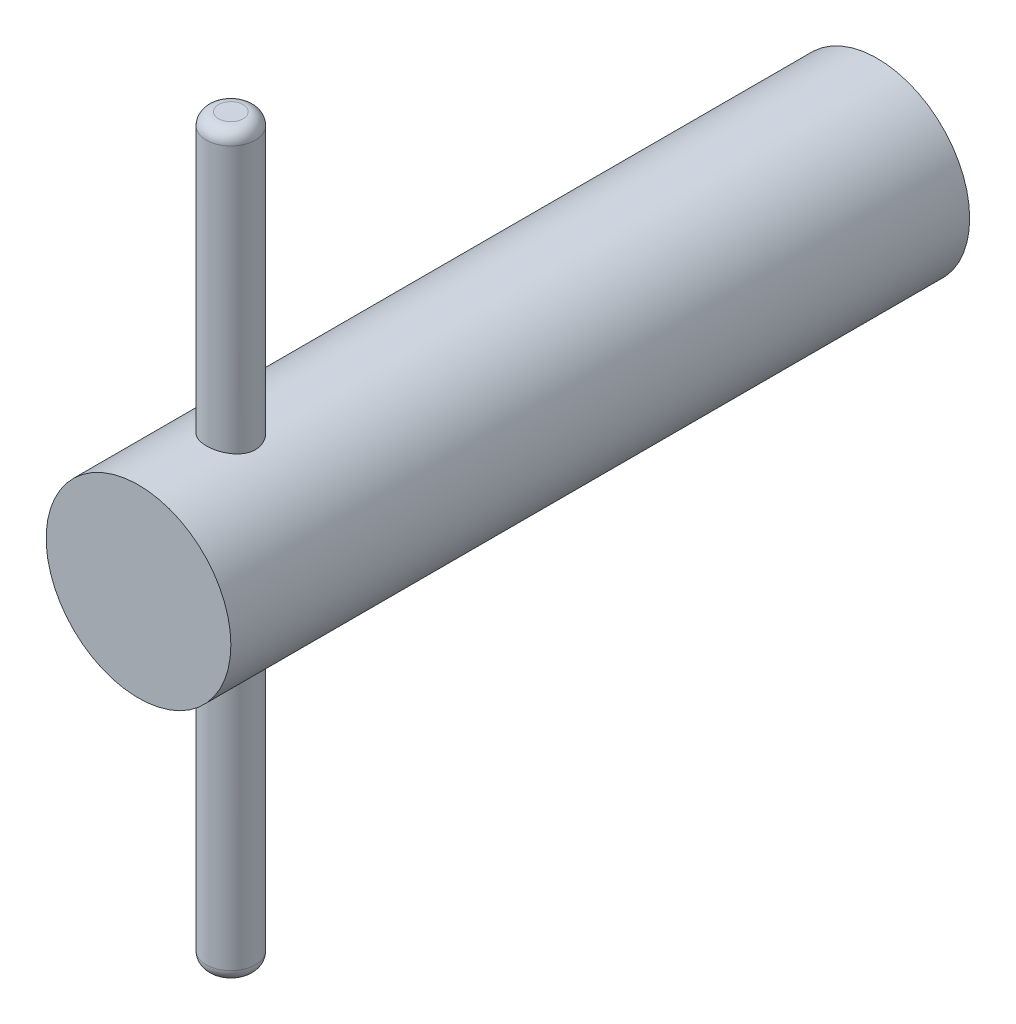
ISO-10303-21;
HEADER;
FILE_DESCRIPTION(('STEP AP214'),'2;1');
FILE_NAME('part.step','',(''),(''),'','','');
FILE_SCHEMA(('AUTOMOTIVE_DESIGN { 1 0 10303 214 1 1 1 1 }'));
ENDSEC;
DATA;
#1=APPLICATION_CONTEXT('core data for automotive mechanical design processes');
#2=APPLICATION_PROTOCOL_DEFINITION('international standard','automotive_design',2000,#1);
#3=PRODUCT_CONTEXT('',#1,'mechanical');
#4=PRODUCT('Part','Part','',(#3));
#5=PRODUCT_RELATED_PRODUCT_CATEGORY('part','',(#4));
#6=PRODUCT_DEFINITION_FORMATION('','',#4);
#7=PRODUCT_DEFINITION_CONTEXT('part definition',#1,'design');
#8=PRODUCT_DEFINITION('design','',#6,#7);
#9=PRODUCT_DEFINITION_SHAPE('','',#8);
#10=(LENGTH_UNIT() NAMED_UNIT(*) SI_UNIT(.MILLI.,.METRE.));
#11=(NAMED_UNIT(*) PLANE_ANGLE_UNIT() SI_UNIT($,.RADIAN.));
#12=(NAMED_UNIT(*) SI_UNIT($,.STERADIAN.) SOLID_ANGLE_UNIT());
#13=UNCERTAINTY_MEASURE_WITH_UNIT(LENGTH_MEASURE(1.E-05),#10,'distance_accuracy_value','');
#14=(GEOMETRIC_REPRESENTATION_CONTEXT(3) GLOBAL_UNCERTAINTY_ASSIGNED_CONTEXT((#13)) GLOBAL_UNIT_ASSIGNED_CONTEXT((#10,
#11,#12)) REPRESENTATION_CONTEXT('',''));
#15=CARTESIAN_POINT('',(0.,0.,0.));
#16=DIRECTION('',(0.,0.,1.));
#17=DIRECTION('',(1.,0.,0.));
#18=AXIS2_PLACEMENT_3D('',#15,#16,#17);
#19=CARTESIAN_POINT('',(0.,0.,120.));
#20=DIRECTION('',(0.,0.,-1.));
#21=DIRECTION('',(-1.,0.,0.));
#22=AXIS2_PLACEMENT_3D('',#19,#20,#21);
#23=CYLINDRICAL_SURFACE('',#22,15.);
#24=CARTESIAN_POINT('',(0.,0.,120.));
#25=DIRECTION('',(0.,0.,1.));
#26=DIRECTION('',(1.,0.,0.));
#27=AXIS2_PLACEMENT_3D('',#24,#25,#26);
#28=CIRCLE('',#27,15.);
#29=CARTESIAN_POINT('',(15.,0.,120.));
#30=VERTEX_POINT('',#29);
#31=EDGE_CURVE('E164',#30,#30,#28,.T.);
#32=ORIENTED_EDGE('',*,*,#31,.F.);
#33=EDGE_LOOP('',(#32));
#34=FACE_BOUND('',#33,.T.);
#35=CARTESIAN_POINT('',(0.,0.,0.));
#36=DIRECTION('',(0.,0.,1.));
#37=DIRECTION('',(1.,0.,0.));
#38=AXIS2_PLACEMENT_3D('',#35,#36,#37);
#39=CIRCLE('',#38,15.);
#40=CARTESIAN_POINT('',(15.,0.,0.));
#41=VERTEX_POINT('',#40);
#42=EDGE_CURVE('E154',#41,#41,#39,.T.);
#43=ORIENTED_EDGE('',*,*,#42,.T.);
#44=EDGE_LOOP('',(#43));
#45=FACE_BOUND('',#44,.T.);
#46=CARTESIAN_POINT('',(0.,-15.,101.));
#47=CARTESIAN_POINT('',(0.220509111665708,-14.9999966762032,101.00000523387));
#48=CARTESIAN_POINT('',(0.44107432044368,-14.995089723243,101.018295228379));
#49=CARTESIAN_POINT('',(0.875850902708927,-14.9759914724332,101.090842461477));
#50=CARTESIAN_POINT('',(1.09005916663817,-14.9617957066517,101.145117008852));
#51=CARTESIAN_POINT('',(1.50578317809062,-14.9256866650558,101.287743333728));
#52=CARTESIAN_POINT('',(1.70731490203056,-14.9037833426075,101.376051175332));
#53=CARTESIAN_POINT('',(2.09270737278531,-14.8545739830336,101.584074485333));
#54=CARTESIAN_POINT('',(2.27656694089925,-14.8272675859036,101.703792046719));
#55=CARTESIAN_POINT('',(2.62565900748003,-14.7694922980399,101.974167032827));
#56=CARTESIAN_POINT('',(2.79042337972558,-14.7389693535736,102.125417336017));
#57=CARTESIAN_POINT('',(3.09257427321276,-14.6785481935918,102.453296966127));
#58=CARTESIAN_POINT('',(3.22995726991329,-14.6486500589449,102.629929555235));
#59=CARTESIAN_POINT('',(3.4757281848683,-14.5923107492874,103.007296469651));
#60=CARTESIAN_POINT('',(3.58357755472975,-14.5659377712648,103.208392656523));
#61=CARTESIAN_POINT('',(3.76375096153988,-14.5204295463637,103.626680222185));
#62=CARTESIAN_POINT('',(3.83608154902738,-14.5012929650653,103.843868624663));
#63=CARTESIAN_POINT('',(3.94153840453008,-14.472982316048,104.28299107565));
#64=CARTESIAN_POINT('',(3.97551340489383,-14.4635929562298,104.504707079861));
#65=CARTESIAN_POINT('',(4.00594069411639,-14.4551966183274,104.950875366613));
#66=CARTESIAN_POINT('',(4.00239999411507,-14.4561877002889,105.175327130048));
#67=CARTESIAN_POINT('',(3.95857020005398,-14.4682475760406,105.613970830748));
#68=CARTESIAN_POINT('',(3.91930812129529,-14.4790347102306,105.828274364077));
#69=CARTESIAN_POINT('',(3.80679497444366,-14.5090202616138,106.247136668912));
#70=CARTESIAN_POINT('',(3.7335411898599,-14.5282193510522,106.451694660151));
#71=CARTESIAN_POINT('',(3.55428713930512,-14.5731132349677,106.847936287617));
#72=CARTESIAN_POINT('',(3.44792682275569,-14.5988788563741,107.039448678573));
#73=CARTESIAN_POINT('',(3.20573007647555,-14.6539645928489,107.402268317703));
#74=CARTESIAN_POINT('',(3.06988784448503,-14.6832854071037,107.573571578313));
#75=CARTESIAN_POINT('',(2.76733214526838,-14.7433502125973,107.89697799491));
#76=CARTESIAN_POINT('',(2.59975625456599,-14.7741094297766,108.04827263663));
#77=CARTESIAN_POINT('',(2.24123533641275,-14.8327276255263,108.320777560701));
#78=CARTESIAN_POINT('',(2.05028938841019,-14.8605864897711,108.441986657405));
#79=CARTESIAN_POINT('',(1.64919651099491,-14.9104364079659,108.651235805649));
#80=CARTESIAN_POINT('',(1.43896980510359,-14.9324014566712,108.739129540897));
#81=CARTESIAN_POINT('',(1.0060045887808,-14.96780088802,108.878094377627));
#82=CARTESIAN_POINT('',(0.783268823856652,-14.981237134675,108.929173525448));
#83=CARTESIAN_POINT('',(0.338508166291034,-14.9977831711677,108.991789753836));
#84=CARTESIAN_POINT('',(0.116648475282763,-15.0011799494192,109.004426079702));
#85=CARTESIAN_POINT('',(-0.326020091802397,-14.9980894338339,108.992833671506));
#86=CARTESIAN_POINT('',(-0.546829074124228,-14.9916031616071,108.968608747788));
#87=CARTESIAN_POINT('',(-0.977204899803559,-14.9696607099204,108.88488310508));
#88=CARTESIAN_POINT('',(-1.18689970405556,-14.9543605309265,108.825995507604));
#89=CARTESIAN_POINT('',(-1.59341394235213,-14.9165258978828,108.675328110984));
#90=CARTESIAN_POINT('',(-1.79023197843205,-14.8939906599234,108.583544747499));
#91=CARTESIAN_POINT('',(-2.1696769493359,-14.8435132111904,108.367652225639));
#92=CARTESIAN_POINT('',(-2.35195037692237,-14.8154737320985,108.242945066405));
#93=CARTESIAN_POINT('',(-2.6933692707943,-14.7572290473119,107.965496739684));
#94=CARTESIAN_POINT('',(-2.85251015759837,-14.7270234145527,107.812750034798));
#95=CARTESIAN_POINT('',(-3.14777848957546,-14.6667949173317,107.478428845011));
#96=CARTESIAN_POINT('',(-3.28313038499627,-14.6368012285772,107.296162877209));
#97=CARTESIAN_POINT('',(-3.52134382370242,-14.5813289436636,106.910870607801));
#98=CARTESIAN_POINT('',(-3.62420672244342,-14.5558501591602,106.707845172756));
#99=CARTESIAN_POINT('',(-3.79374823172205,-14.5125853674305,106.287809385847));
#100=CARTESIAN_POINT('',(-3.86063624507841,-14.4947549662348,106.070888376362));
#101=CARTESIAN_POINT('',(-3.95682410237657,-14.4687965026614,105.628321360653));
#102=CARTESIAN_POINT('',(-3.98613355205236,-14.4606659608681,105.402677599313));
#103=CARTESIAN_POINT('',(-4.00577979307212,-14.4552348910192,104.957010424211));
#104=CARTESIAN_POINT('',(-3.99736311235129,-14.4575879532022,104.737045359427));
#105=CARTESIAN_POINT('',(-3.94468751999858,-14.4720479199639,104.30179297193));
#106=CARTESIAN_POINT('',(-3.9004295306998,-14.4841545735456,104.08650552899));
#107=CARTESIAN_POINT('',(-3.77805031399794,-14.5165514219021,103.66828849576));
#108=CARTESIAN_POINT('',(-3.70019322151266,-14.5367777005106,103.465276314541));
#109=CARTESIAN_POINT('',(-3.51303109124666,-14.5831363626058,103.075042338926));
#110=CARTESIAN_POINT('',(-3.40372112049204,-14.6092696723953,102.887823027398));
#111=CARTESIAN_POINT('',(-3.15297818537663,-14.6654584288421,102.528539281008));
#112=CARTESIAN_POINT('',(-3.01069459535827,-14.6956066620426,102.357082930048));
#113=CARTESIAN_POINT('',(-2.69966107022193,-14.7559100756513,102.040075096665));
#114=CARTESIAN_POINT('',(-2.53090470871747,-14.7860652559664,101.894529922662));
#115=CARTESIAN_POINT('',(-2.16735996217739,-14.8437562480818,101.630415524706));
#116=CARTESIAN_POINT('',(-1.97209192350357,-14.8712222262917,101.512489978701));
#117=CARTESIAN_POINT('',(-1.56377728083377,-14.9196762020573,101.311325168141));
#118=CARTESIAN_POINT('',(-1.35074218939259,-14.9406683536717,101.228063648673));
#119=CARTESIAN_POINT('',(-0.948749409761977,-14.9710950502695,101.109449429169));
#120=CARTESIAN_POINT('',(-0.761524033130068,-14.9818554118521,101.068501232815));
#121=CARTESIAN_POINT('',(-0.382879590634151,-14.9963089807291,101.013775587666));
#122=CARTESIAN_POINT('',(-0.19146094080972,-15.0000028859454,100.9999954556));
#123=CARTESIAN_POINT('',(0.,-15.,101.));
#124=B_SPLINE_CURVE_WITH_KNOTS('',3,(#46,#47,#48,#49,#50,#51,#52,#53,#54,#55,#56,#57,#58,#59,
#60,#61,#62,#63,#64,#65,#66,#67,#68,#69,#70,#71,#72,#73,#74,#75,#76,#77,#78,#79,#80,#81,#82,#83,
#84,#85,#86,#87,#88,#89,#90,#91,#92,#93,#94,#95,#96,#97,#98,#99,#100,#101,#102,#103,#104,#105,
#106,#107,#108,#109,#110,#111,#112,#113,#114,#115,#116,#117,#118,#119,#120,#121,#122,#123),
.UNSPECIFIED.,.T.,.F.,(4,2,2,2,2,2,2,2,2,2,2,2,2,2,2,2,2,2,2,2,2,2,2,2,2,2,2,2,2,2,2,2,2,2,2,2,
2,2,4),(0.,0.660825197899138,1.3219684875229,1.98226110594386,2.64259773417351,3.31669795909934,
3.99088489850298,4.67665165046457,5.36229188259399,6.03244316500937,6.7024692080864,
7.35382004091993,8.00522293625879,8.66397346692996,9.3228537623526,10.0032251962464,
10.6836234387519,11.3669761920608,12.0501795438028,12.7136543504909,13.377060578507,
14.0290707128423,14.6811515155123,15.346005720091,16.0109913651777,16.6947299276558,
17.3784399604822,18.0581259539877,18.7376381732797,19.394866848109,20.0520786104837,
20.7042153090379,21.356454342532,22.0278867914997,22.6994824867209,23.3854450456898,
24.0709665229755,24.6447963799386,25.2185695593995),.UNSPECIFIED.);
#125=CARTESIAN_POINT('',(0.,-15.,101.));
#126=VERTEX_POINT('',#125);
#127=EDGE_CURVE('E168',#126,#126,#124,.T.);
#128=ORIENTED_EDGE('',*,*,#127,.F.);
#129=EDGE_LOOP('',(#128));
#130=FACE_BOUND('',#129,.T.);
#131=CARTESIAN_POINT('',(0.,15.,101.));
#132=CARTESIAN_POINT('',(-0.220509111665708,14.9999966762032,101.00000523387));
#133=CARTESIAN_POINT('',(-0.44107432044368,14.995089723243,101.018295228379));
#134=CARTESIAN_POINT('',(-0.875850902708927,14.9759914724332,101.090842461477));
#135=CARTESIAN_POINT('',(-1.09005916663817,14.9617957066517,101.145117008852));
#136=CARTESIAN_POINT('',(-1.50578317809062,14.9256866650558,101.287743333728));
#137=CARTESIAN_POINT('',(-1.70731490203056,14.9037833426075,101.376051175332));
#138=CARTESIAN_POINT('',(-2.09270737278531,14.8545739830336,101.584074485333));
#139=CARTESIAN_POINT('',(-2.27656694089925,14.8272675859036,101.703792046719));
#140=CARTESIAN_POINT('',(-2.62565900748003,14.7694922980399,101.974167032827));
#141=CARTESIAN_POINT('',(-2.79042337972558,14.7389693535736,102.125417336017));
#142=CARTESIAN_POINT('',(-3.09257427321276,14.6785481935918,102.453296966127));
#143=CARTESIAN_POINT('',(-3.22995726991329,14.6486500589449,102.629929555235));
#144=CARTESIAN_POINT('',(-3.4757281848683,14.5923107492874,103.007296469651));
#145=CARTESIAN_POINT('',(-3.58357755472975,14.5659377712648,103.208392656523));
#146=CARTESIAN_POINT('',(-3.76375096153988,14.5204295463637,103.626680222185));
#147=CARTESIAN_POINT('',(-3.83608154902738,14.5012929650653,103.843868624663));
#148=CARTESIAN_POINT('',(-3.94153840453008,14.472982316048,104.28299107565));
#149=CARTESIAN_POINT('',(-3.97551340489383,14.4635929562298,104.504707079861));
#150=CARTESIAN_POINT('',(-4.00594069411639,14.4551966183274,104.950875366613));
#151=CARTESIAN_POINT('',(-4.00239999411507,14.4561877002889,105.175327130048));
#152=CARTESIAN_POINT('',(-3.95857020005398,14.4682475760406,105.613970830748));
#153=CARTESIAN_POINT('',(-3.91930812129529,14.4790347102306,105.828274364077));
#154=CARTESIAN_POINT('',(-3.80679497444366,14.5090202616138,106.247136668912));
#155=CARTESIAN_POINT('',(-3.7335411898599,14.5282193510522,106.451694660151));
#156=CARTESIAN_POINT('',(-3.55428713930512,14.5731132349677,106.847936287617));
#157=CARTESIAN_POINT('',(-3.44792682275569,14.5988788563741,107.039448678573));
#158=CARTESIAN_POINT('',(-3.20573007647555,14.6539645928489,107.402268317703));
#159=CARTESIAN_POINT('',(-3.06988784448503,14.6832854071037,107.573571578313));
#160=CARTESIAN_POINT('',(-2.76733214526838,14.7433502125973,107.89697799491));
#161=CARTESIAN_POINT('',(-2.59975625456599,14.7741094297766,108.04827263663));
#162=CARTESIAN_POINT('',(-2.24123533641275,14.8327276255263,108.320777560701));
#163=CARTESIAN_POINT('',(-2.05028938841019,14.8605864897711,108.441986657405));
#164=CARTESIAN_POINT('',(-1.64919651099491,14.9104364079659,108.651235805649));
#165=CARTESIAN_POINT('',(-1.43896980510359,14.9324014566712,108.739129540897));
#166=CARTESIAN_POINT('',(-1.0060045887808,14.96780088802,108.878094377627));
#167=CARTESIAN_POINT('',(-0.783268823856652,14.981237134675,108.929173525448));
#168=CARTESIAN_POINT('',(-0.338508166291034,14.9977831711677,108.991789753836));
#169=CARTESIAN_POINT('',(-0.116648475282763,15.0011799494192,109.004426079702));
#170=CARTESIAN_POINT('',(0.326020091802397,14.9980894338339,108.992833671506));
#171=CARTESIAN_POINT('',(0.546829074124228,14.9916031616071,108.968608747788));
#172=CARTESIAN_POINT('',(0.977204899803559,14.9696607099204,108.88488310508));
#173=CARTESIAN_POINT('',(1.18689970405556,14.9543605309265,108.825995507604));
#174=CARTESIAN_POINT('',(1.59341394235213,14.9165258978828,108.675328110984));
#175=CARTESIAN_POINT('',(1.79023197843205,14.8939906599234,108.583544747499));
#176=CARTESIAN_POINT('',(2.1696769493359,14.8435132111904,108.367652225639));
#177=CARTESIAN_POINT('',(2.35195037692237,14.8154737320985,108.242945066405));
#178=CARTESIAN_POINT('',(2.6933692707943,14.7572290473119,107.965496739684));
#179=CARTESIAN_POINT('',(2.85251015759837,14.7270234145527,107.812750034798));
#180=CARTESIAN_POINT('',(3.14777848957546,14.6667949173317,107.478428845011));
#181=CARTESIAN_POINT('',(3.28313038499627,14.6368012285772,107.296162877209));
#182=CARTESIAN_POINT('',(3.52134382370242,14.5813289436636,106.910870607801));
#183=CARTESIAN_POINT('',(3.62420672244342,14.5558501591602,106.707845172756));
#184=CARTESIAN_POINT('',(3.79374823172205,14.5125853674305,106.287809385847));
#185=CARTESIAN_POINT('',(3.86063624507841,14.4947549662348,106.070888376362));
#186=CARTESIAN_POINT('',(3.95682410237657,14.4687965026614,105.628321360653));
#187=CARTESIAN_POINT('',(3.98613355205236,14.4606659608681,105.402677599313));
#188=CARTESIAN_POINT('',(4.00577979307212,14.4552348910192,104.957010424211));
#189=CARTESIAN_POINT('',(3.99736311235129,14.4575879532022,104.737045359427));
#190=CARTESIAN_POINT('',(3.94468751999858,14.4720479199639,104.30179297193));
#191=CARTESIAN_POINT('',(3.9004295306998,14.4841545735456,104.08650552899));
#192=CARTESIAN_POINT('',(3.77805031399794,14.5165514219021,103.66828849576));
#193=CARTESIAN_POINT('',(3.70019322151266,14.5367777005106,103.465276314541));
#194=CARTESIAN_POINT('',(3.51303109124666,14.5831363626058,103.075042338926));
#195=CARTESIAN_POINT('',(3.40372112049204,14.6092696723953,102.887823027398));
#196=CARTESIAN_POINT('',(3.15297818537663,14.6654584288421,102.528539281008));
#197=CARTESIAN_POINT('',(3.01069459535827,14.6956066620426,102.357082930048));
#198=CARTESIAN_POINT('',(2.69966107022193,14.7559100756513,102.040075096665));
#199=CARTESIAN_POINT('',(2.53090470871747,14.7860652559664,101.894529922662));
#200=CARTESIAN_POINT('',(2.16735996217739,14.8437562480818,101.630415524706));
#201=CARTESIAN_POINT('',(1.97209192350357,14.8712222262917,101.512489978701));
#202=CARTESIAN_POINT('',(1.56377728083377,14.9196762020573,101.311325168141));
#203=CARTESIAN_POINT('',(1.35074218939259,14.9406683536717,101.228063648673));
#204=CARTESIAN_POINT('',(0.948749409761977,14.9710950502695,101.109449429169));
#205=CARTESIAN_POINT('',(0.761524033130068,14.9818554118521,101.068501232815));
#206=CARTESIAN_POINT('',(0.382879590634151,14.9963089807291,101.013775587666));
#207=CARTESIAN_POINT('',(0.19146094080972,15.0000028859454,100.9999954556));
#208=CARTESIAN_POINT('',(0.,15.,101.));
#209=B_SPLINE_CURVE_WITH_KNOTS('',3,(#131,#132,#133,#134,#135,#136,#137,#138,#139,#140,#141,
#142,#143,#144,#145,#146,#147,#148,#149,#150,#151,#152,#153,#154,#155,#156,#157,#158,#159,#160,
#161,#162,#163,#164,#165,#166,#167,#168,#169,#170,#171,#172,#173,#174,#175,#176,#177,#178,#179,
#180,#181,#182,#183,#184,#185,#186,#187,#188,#189,#190,#191,#192,#193,#194,#195,#196,#197,#198,
#199,#200,#201,#202,#203,#204,#205,#206,#207,#208),.UNSPECIFIED.,.T.,.F.,(4,2,2,2,2,2,2,2,2,2,2,
2,2,2,2,2,2,2,2,2,2,2,2,2,2,2,2,2,2,2,2,2,2,2,2,2,2,2,4),(0.,0.660825197899138,1.3219684875229,
1.98226110594386,2.64259773417351,3.31669795909934,3.99088489850298,4.67665165046457,
5.36229188259399,6.03244316500937,6.7024692080864,7.35382004091993,8.00522293625879,
8.66397346692996,9.3228537623526,10.0032251962464,10.6836234387519,11.3669761920608,
12.0501795438028,12.7136543504909,13.377060578507,14.0290707128423,14.6811515155123,
15.346005720091,16.0109913651777,16.6947299276558,17.3784399604822,18.0581259539877,
18.7376381732797,19.394866848109,20.0520786104837,20.7042153090379,21.356454342532,
22.0278867914997,22.6994824867209,23.3854450456898,24.0709665229755,24.6447963799386,
25.2185695593995),.UNSPECIFIED.);
#210=CARTESIAN_POINT('',(0.,15.,101.));
#211=VERTEX_POINT('',#210);
#212=EDGE_CURVE('E180',#211,#211,#209,.T.);
#213=ORIENTED_EDGE('',*,*,#212,.F.);
#214=EDGE_LOOP('',(#213));
#215=FACE_BOUND('',#214,.T.);
#216=ADVANCED_FACE('F39',(#34,#45,#130,#215),#23,.T.);
#217=CARTESIAN_POINT('',(0.,0.,120.));
#218=DIRECTION('',(0.,0.,1.));
#219=DIRECTION('',(1.,0.,0.));
#220=AXIS2_PLACEMENT_3D('',#217,#218,#219);
#221=PLANE('',#220);
#222=ORIENTED_EDGE('',*,*,#31,.T.);
#223=EDGE_LOOP('',(#222));
#224=FACE_BOUND('',#223,.T.);
#225=ADVANCED_FACE('F219',(#224),#221,.T.);
#226=CARTESIAN_POINT('',(0.,0.,0.));
#227=DIRECTION('',(0.,0.,1.));
#228=DIRECTION('',(1.,0.,0.));
#229=AXIS2_PLACEMENT_3D('',#226,#227,#228);
#230=PLANE('',#229);
#231=DIRECTION('',(0.999994954580918,-0.00317660395844476,0.));
#232=VECTOR('',#231,1.);
#233=CARTESIAN_POINT('',(-5.74170752257116,10.0182896773143,0.));
#234=LINE('',#233,#232);
#235=CARTESIAN_POINT('',(-5.74170752257116,10.0182896773143,0.));
#236=VERTEX_POINT('',#235);
#237=CARTESIAN_POINT('',(5.80523960174005,9.98160941430401,0.));
#238=VERTEX_POINT('',#237);
#239=EDGE_CURVE('E135',#236,#238,#234,.T.);
#240=ORIENTED_EDGE('',*,*,#239,.F.);
#241=DIRECTION('',(0.502748497016234,0.864432732344118,0.));
#242=VECTOR('',#241,1.);
#243=CARTESIAN_POINT('',(-11.5469471243112,0.0366802630103418,0.));
#244=LINE('',#243,#242);
#245=CARTESIAN_POINT('',(-11.5469471243112,0.0366802630103418,0.));
#246=VERTEX_POINT('',#245);
#247=EDGE_CURVE('E55',#246,#236,#244,.T.);
#248=ORIENTED_EDGE('',*,*,#247,.F.);
#249=DIRECTION('',(-0.497246457564683,0.867609336302563,0.));
#250=VECTOR('',#249,1.);
#251=CARTESIAN_POINT('',(-5.80523960174005,-9.98160941430401,0.));
#252=LINE('',#251,#250);
#253=CARTESIAN_POINT('',(-5.80523960174005,-9.98160941430401,0.));
#254=VERTEX_POINT('',#253);
#255=EDGE_CURVE('E148',#254,#246,#252,.T.);
#256=ORIENTED_EDGE('',*,*,#255,.F.);
#257=DIRECTION('',(-0.999994954580917,0.00317660395844491,0.));
#258=VECTOR('',#257,1.);
#259=CARTESIAN_POINT('',(5.74170752257115,-10.0182896773143,0.));
#260=LINE('',#259,#258);
#261=CARTESIAN_POINT('',(5.74170752257115,-10.0182896773143,0.));
#262=VERTEX_POINT('',#261);
#263=EDGE_CURVE('E145',#262,#254,#260,.T.);
#264=ORIENTED_EDGE('',*,*,#263,.F.);
#265=DIRECTION('',(-0.502748497016234,-0.864432732344118,0.));
#266=VECTOR('',#265,1.);
#267=CARTESIAN_POINT('',(11.5469471243112,-0.0366802630103424,0.));
#268=LINE('',#267,#266);
#269=CARTESIAN_POINT('',(11.5469471243112,-0.0366802630103424,0.));
#270=VERTEX_POINT('',#269);
#271=EDGE_CURVE('E103',#270,#262,#268,.T.);
#272=ORIENTED_EDGE('',*,*,#271,.F.);
#273=DIRECTION('',(0.497246457564683,-0.867609336302563,0.));
#274=VECTOR('',#273,1.);
#275=CARTESIAN_POINT('',(5.80523960174005,9.98160941430401,0.));
#276=LINE('',#275,#274);
#277=EDGE_CURVE('E139',#238,#270,#276,.T.);
#278=ORIENTED_EDGE('',*,*,#277,.F.);
#279=EDGE_LOOP('',(#240,#248,#256,#264,#272,#278));
#280=FACE_BOUND('',#279,.T.);
#281=ORIENTED_EDGE('',*,*,#42,.F.);
#282=EDGE_LOOP('',(#281));
#283=FACE_BOUND('',#282,.T.);
#284=ADVANCED_FACE('F218',(#280,#283),#230,.F.);
#285=CARTESIAN_POINT('',(-11.5469471243112,0.0366802630103418,50.));
#286=DIRECTION('',(-0.864432732344118,0.502748497016234,0.));
#287=DIRECTION('',(-0.502748497016234,-0.864432732344118,0.));
#288=AXIS2_PLACEMENT_3D('',#285,#286,#287);
#289=PLANE('',#288);
#290=ORIENTED_EDGE('',*,*,#247,.T.);
#291=DIRECTION('',(0.,0.,-1.));
#292=VECTOR('',#291,1.);
#293=CARTESIAN_POINT('',(-5.74170752257116,10.0182896773143,50.));
#294=LINE('',#293,#292);
#295=CARTESIAN_POINT('',(-5.74170752257116,10.0182896773143,50.));
#296=VERTEX_POINT('',#295);
#297=EDGE_CURVE('E85',#296,#236,#294,.T.);
#298=ORIENTED_EDGE('',*,*,#297,.F.);
#299=DIRECTION('',(0.502748497016234,0.864432732344118,0.));
#300=VECTOR('',#299,1.);
#301=CARTESIAN_POINT('',(-11.5469471243112,0.0366802630103418,50.));
#302=LINE('',#301,#300);
#303=CARTESIAN_POINT('',(-11.5469471243112,0.0366802630103418,50.));
#304=VERTEX_POINT('',#303);
#305=EDGE_CURVE('E151',#304,#296,#302,.T.);
#306=ORIENTED_EDGE('',*,*,#305,.F.);
#307=DIRECTION('',(0.,0.,-1.));
#308=VECTOR('',#307,1.);
#309=CARTESIAN_POINT('',(-11.5469471243112,0.0366802630103418,50.));
#310=LINE('',#309,#308);
#311=EDGE_CURVE('E63',#304,#246,#310,.T.);
#312=ORIENTED_EDGE('',*,*,#311,.T.);
#313=EDGE_LOOP('',(#290,#298,#306,#312));
#314=FACE_BOUND('',#313,.T.);
#315=ADVANCED_FACE('F204',(#314),#289,.F.);
#316=CARTESIAN_POINT('',(-5.80523960174005,-9.98160941430401,50.));
#317=DIRECTION('',(-0.867609336302563,-0.497246457564683,0.));
#318=DIRECTION('',(0.497246457564683,-0.867609336302563,0.));
#319=AXIS2_PLACEMENT_3D('',#316,#317,#318);
#320=PLANE('',#319);
#321=ORIENTED_EDGE('',*,*,#255,.T.);
#322=ORIENTED_EDGE('',*,*,#311,.F.);
#323=DIRECTION('',(-0.497246457564683,0.867609336302563,0.));
#324=VECTOR('',#323,1.);
#325=CARTESIAN_POINT('',(-5.80523960174005,-9.98160941430401,50.));
#326=LINE('',#325,#324);
#327=CARTESIAN_POINT('',(-5.80523960174005,-9.98160941430401,50.));
#328=VERTEX_POINT('',#327);
#329=EDGE_CURVE('E117',#328,#304,#326,.T.);
#330=ORIENTED_EDGE('',*,*,#329,.F.);
#331=DIRECTION('',(0.,0.,-1.));
#332=VECTOR('',#331,1.);
#333=CARTESIAN_POINT('',(-5.80523960174005,-9.98160941430401,50.));
#334=LINE('',#333,#332);
#335=EDGE_CURVE('E108',#328,#254,#334,.T.);
#336=ORIENTED_EDGE('',*,*,#335,.T.);
#337=EDGE_LOOP('',(#321,#322,#330,#336));
#338=FACE_BOUND('',#337,.T.);
#339=ADVANCED_FACE('F201',(#338),#320,.F.);
#340=CARTESIAN_POINT('',(5.74170752257115,-10.0182896773143,50.));
#341=DIRECTION('',(-0.00317660395844491,-0.999994954580917,0.));
#342=DIRECTION('',(0.999994954580917,-0.00317660395844491,0.));
#343=AXIS2_PLACEMENT_3D('',#340,#341,#342);
#344=PLANE('',#343);
#345=ORIENTED_EDGE('',*,*,#263,.T.);
#346=ORIENTED_EDGE('',*,*,#335,.F.);
#347=DIRECTION('',(-0.999994954580917,0.00317660395844491,0.));
#348=VECTOR('',#347,1.);
#349=CARTESIAN_POINT('',(5.74170752257115,-10.0182896773143,50.));
#350=LINE('',#349,#348);
#351=CARTESIAN_POINT('',(5.74170752257115,-10.0182896773143,50.));
#352=VERTEX_POINT('',#351);
#353=EDGE_CURVE('E112',#352,#328,#350,.T.);
#354=ORIENTED_EDGE('',*,*,#353,.F.);
#355=DIRECTION('',(0.,0.,-1.));
#356=VECTOR('',#355,1.);
#357=CARTESIAN_POINT('',(5.74170752257115,-10.0182896773143,50.));
#358=LINE('',#357,#356);
#359=EDGE_CURVE('E96',#352,#262,#358,.T.);
#360=ORIENTED_EDGE('',*,*,#359,.T.);
#361=EDGE_LOOP('',(#345,#346,#354,#360));
#362=FACE_BOUND('',#361,.T.);
#363=ADVANCED_FACE('F113',(#362),#344,.F.);
#364=CARTESIAN_POINT('',(11.5469471243112,-0.0366802630103424,50.));
#365=DIRECTION('',(0.864432732344118,-0.502748497016234,0.));
#366=DIRECTION('',(0.502748497016234,0.864432732344118,0.));
#367=AXIS2_PLACEMENT_3D('',#364,#365,#366);
#368=PLANE('',#367);
#369=ORIENTED_EDGE('',*,*,#271,.T.);
#370=ORIENTED_EDGE('',*,*,#359,.F.);
#371=DIRECTION('',(-0.502748497016234,-0.864432732344118,0.));
#372=VECTOR('',#371,1.);
#373=CARTESIAN_POINT('',(11.5469471243112,-0.0366802630103424,50.));
#374=LINE('',#373,#372);
#375=CARTESIAN_POINT('',(11.5469471243112,-0.0366802630103424,50.));
#376=VERTEX_POINT('',#375);
#377=EDGE_CURVE('E100',#376,#352,#374,.T.);
#378=ORIENTED_EDGE('',*,*,#377,.F.);
#379=DIRECTION('',(0.,0.,-1.));
#380=VECTOR('',#379,1.);
#381=CARTESIAN_POINT('',(11.5469471243112,-0.0366802630103424,50.));
#382=LINE('',#381,#380);
#383=EDGE_CURVE('E109',#376,#270,#382,.T.);
#384=ORIENTED_EDGE('',*,*,#383,.T.);
#385=EDGE_LOOP('',(#369,#370,#378,#384));
#386=FACE_BOUND('',#385,.T.);
#387=ADVANCED_FACE('F98',(#386),#368,.F.);
#388=CARTESIAN_POINT('',(5.80523960174005,9.98160941430401,50.));
#389=DIRECTION('',(0.867609336302563,0.497246457564683,0.));
#390=DIRECTION('',(-0.497246457564683,0.867609336302563,0.));
#391=AXIS2_PLACEMENT_3D('',#388,#389,#390);
#392=PLANE('',#391);
#393=ORIENTED_EDGE('',*,*,#277,.T.);
#394=ORIENTED_EDGE('',*,*,#383,.F.);
#395=DIRECTION('',(0.497246457564683,-0.867609336302563,0.));
#396=VECTOR('',#395,1.);
#397=CARTESIAN_POINT('',(5.80523960174005,9.98160941430401,50.));
#398=LINE('',#397,#396);
#399=CARTESIAN_POINT('',(5.80523960174005,9.98160941430401,50.));
#400=VERTEX_POINT('',#399);
#401=EDGE_CURVE('E123',#400,#376,#398,.T.);
#402=ORIENTED_EDGE('',*,*,#401,.F.);
#403=DIRECTION('',(0.,0.,-1.));
#404=VECTOR('',#403,1.);
#405=CARTESIAN_POINT('',(5.80523960174005,9.98160941430401,50.));
#406=LINE('',#405,#404);
#407=EDGE_CURVE('E159',#400,#238,#406,.T.);
#408=ORIENTED_EDGE('',*,*,#407,.T.);
#409=EDGE_LOOP('',(#393,#394,#402,#408));
#410=FACE_BOUND('',#409,.T.);
#411=ADVANCED_FACE('F209',(#410),#392,.F.);
#412=CARTESIAN_POINT('',(-5.74170752257116,10.0182896773143,50.));
#413=DIRECTION('',(0.00317660395844476,0.999994954580917,0.));
#414=DIRECTION('',(-0.999994954580917,0.00317660395844476,0.));
#415=AXIS2_PLACEMENT_3D('',#412,#413,#414);
#416=PLANE('',#415);
#417=ORIENTED_EDGE('',*,*,#239,.T.);
#418=ORIENTED_EDGE('',*,*,#407,.F.);
#419=DIRECTION('',(0.999994954580918,-0.00317660395844476,0.));
#420=VECTOR('',#419,1.);
#421=CARTESIAN_POINT('',(-5.74170752257116,10.0182896773143,50.));
#422=LINE('',#421,#420);
#423=EDGE_CURVE('E127',#296,#400,#422,.T.);
#424=ORIENTED_EDGE('',*,*,#423,.F.);
#425=ORIENTED_EDGE('',*,*,#297,.T.);
#426=EDGE_LOOP('',(#417,#418,#424,#425));
#427=FACE_BOUND('',#426,.T.);
#428=ADVANCED_FACE('F200',(#427),#416,.F.);
#429=CARTESIAN_POINT('',(0.,0.,50.));
#430=DIRECTION('',(0.,0.,-1.));
#431=DIRECTION('',(-1.,0.,0.));
#432=AXIS2_PLACEMENT_3D('',#429,#430,#431);
#433=PLANE('',#432);
#434=ORIENTED_EDGE('',*,*,#305,.T.);
#435=ORIENTED_EDGE('',*,*,#423,.T.);
#436=ORIENTED_EDGE('',*,*,#401,.T.);
#437=ORIENTED_EDGE('',*,*,#377,.T.);
#438=ORIENTED_EDGE('',*,*,#353,.T.);
#439=ORIENTED_EDGE('',*,*,#329,.T.);
#440=EDGE_LOOP('',(#434,#435,#436,#437,#438,#439));
#441=FACE_BOUND('',#440,.T.);
#442=ADVANCED_FACE('F120',(#441),#433,.T.);
#443=CARTESIAN_POINT('',(0.,-60.,105.));
#444=DIRECTION('',(0.,1.,0.));
#445=DIRECTION('',(0.,0.,1.));
#446=AXIS2_PLACEMENT_3D('',#443,#444,#445);
#447=PLANE('',#446);
#448=CARTESIAN_POINT('',(0.,-60.,105.));
#449=DIRECTION('',(0.,1.,0.));
#450=DIRECTION('',(0.,0.,1.));
#451=AXIS2_PLACEMENT_3D('',#448,#449,#450);
#452=CIRCLE('',#451,2.);
#453=CARTESIAN_POINT('',(0.,-60.,107.));
#454=VERTEX_POINT('',#453);
#455=EDGE_CURVE('E245',#454,#454,#452,.F.);
#456=ORIENTED_EDGE('',*,*,#455,.T.);
#457=EDGE_LOOP('',(#456));
#458=FACE_BOUND('',#457,.T.);
#459=ADVANCED_FACE('F195',(#458),#447,.F.);
#460=CARTESIAN_POINT('',(0.,60.,105.));
#461=DIRECTION('',(0.,-1.,0.));
#462=DIRECTION('',(0.,0.,-1.));
#463=AXIS2_PLACEMENT_3D('',#460,#461,#462);
#464=CYLINDRICAL_SURFACE('',#463,4.);
#465=CARTESIAN_POINT('',(0.,-58.,105.));
#466=DIRECTION('',(0.,1.,0.));
#467=DIRECTION('',(0.,0.,1.));
#468=AXIS2_PLACEMENT_3D('',#465,#466,#467);
#469=CIRCLE('',#468,4.);
#470=CARTESIAN_POINT('',(0.,-58.,109.));
#471=VERTEX_POINT('',#470);
#472=EDGE_CURVE('E242',#471,#471,#469,.T.);
#473=ORIENTED_EDGE('',*,*,#472,.T.);
#474=EDGE_LOOP('',(#473));
#475=FACE_BOUND('',#474,.T.);
#476=ORIENTED_EDGE('',*,*,#127,.T.);
#477=EDGE_LOOP('',(#476));
#478=FACE_BOUND('',#477,.T.);
#479=ADVANCED_FACE('F193',(#475,#478),#464,.T.);
#480=CARTESIAN_POINT('',(0.,58.,105.));
#481=DIRECTION('',(0.,1.,0.));
#482=DIRECTION('',(0.,0.,1.));
#483=AXIS2_PLACEMENT_3D('',#480,#481,#482);
#484=CIRCLE('',#483,4.);
#485=CARTESIAN_POINT('',(0.,58.,109.));
#486=VERTEX_POINT('',#485);
#487=EDGE_CURVE('E11',#486,#486,#484,.F.);
#488=ORIENTED_EDGE('',*,*,#487,.T.);
#489=EDGE_LOOP('',(#488));
#490=FACE_BOUND('',#489,.T.);
#491=ORIENTED_EDGE('',*,*,#212,.T.);
#492=EDGE_LOOP('',(#491));
#493=FACE_BOUND('',#492,.T.);
#494=ADVANCED_FACE('F187',(#490,#493),#464,.T.);
#495=CARTESIAN_POINT('',(0.,60.,105.));
#496=DIRECTION('',(0.,1.,0.));
#497=DIRECTION('',(0.,0.,1.));
#498=AXIS2_PLACEMENT_3D('',#495,#496,#497);
#499=PLANE('',#498);
#500=CARTESIAN_POINT('',(0.,60.,105.));
#501=DIRECTION('',(0.,1.,0.));
#502=DIRECTION('',(0.,0.,1.));
#503=AXIS2_PLACEMENT_3D('',#500,#501,#502);
#504=CIRCLE('',#503,2.);
#505=CARTESIAN_POINT('',(0.,60.,107.));
#506=VERTEX_POINT('',#505);
#507=EDGE_CURVE('E48',#506,#506,#504,.T.);
#508=ORIENTED_EDGE('',*,*,#507,.T.);
#509=EDGE_LOOP('',(#508));
#510=FACE_BOUND('',#509,.T.);
#511=ADVANCED_FACE('F192',(#510),#499,.T.);
#512=CARTESIAN_POINT('',(0.,-58.,105.));
#513=DIRECTION('',(0.,1.,0.));
#514=DIRECTION('',(0.,0.,1.));
#515=AXIS2_PLACEMENT_3D('',#512,#513,#514);
#516=TOROIDAL_SURFACE('',#515,2.,2.);
#517=ORIENTED_EDGE('',*,*,#455,.F.);
#518=EDGE_LOOP('',(#517));
#519=FACE_BOUND('',#518,.T.);
#520=ORIENTED_EDGE('',*,*,#472,.F.);
#521=EDGE_LOOP('',(#520));
#522=FACE_BOUND('',#521,.T.);
#523=ADVANCED_FACE('F257',(#519,#522),#516,.T.);
#524=CARTESIAN_POINT('',(0.,58.,105.));
#525=DIRECTION('',(0.,1.,0.));
#526=DIRECTION('',(0.,0.,1.));
#527=AXIS2_PLACEMENT_3D('',#524,#525,#526);
#528=TOROIDAL_SURFACE('',#527,2.,2.);
#529=ORIENTED_EDGE('',*,*,#487,.F.);
#530=EDGE_LOOP('',(#529));
#531=FACE_BOUND('',#530,.T.);
#532=ORIENTED_EDGE('',*,*,#507,.F.);
#533=EDGE_LOOP('',(#532));
#534=FACE_BOUND('',#533,.T.);
#535=ADVANCED_FACE('F41',(#531,#534),#528,.T.);
#536=CLOSED_SHELL('',(#216,#225,#284,#315,#339,#363,#387,#411,#428,#442,#459,#479,#494,#511,
#523,#535));
#537=MANIFOLD_SOLID_BREP('B2',#536);
#538=ADVANCED_BREP_SHAPE_REPRESENTATION('',(#18,#537),#14);
#539=SHAPE_DEFINITION_REPRESENTATION(#9,#538);
ENDSEC;
END-ISO-10303-21;
